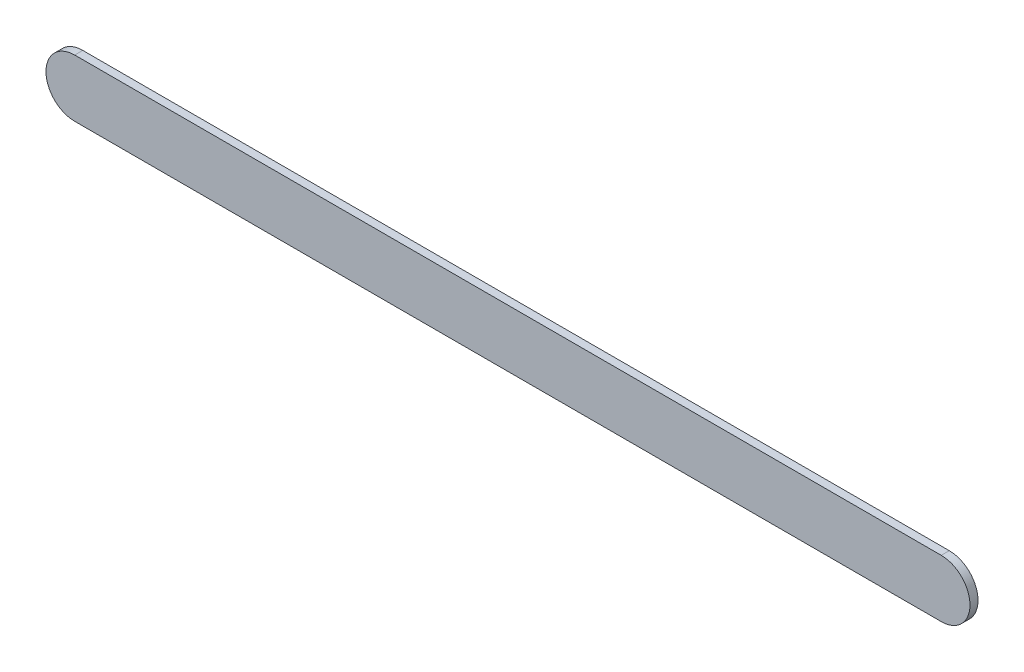
ISO-10303-21;
HEADER;
FILE_DESCRIPTION(('STEP AP214'),'2;1');
FILE_NAME('part.step','',(''),(''),'','','');
FILE_SCHEMA(('AUTOMOTIVE_DESIGN { 1 0 10303 214 1 1 1 1 }'));
ENDSEC;
DATA;
#1=APPLICATION_CONTEXT('core data for automotive mechanical design processes');
#2=APPLICATION_PROTOCOL_DEFINITION('international standard','automotive_design',2000,#1);
#3=PRODUCT_CONTEXT('',#1,'mechanical');
#4=PRODUCT('Part','Part','',(#3));
#5=PRODUCT_RELATED_PRODUCT_CATEGORY('part','',(#4));
#6=PRODUCT_DEFINITION_FORMATION('','',#4);
#7=PRODUCT_DEFINITION_CONTEXT('part definition',#1,'design');
#8=PRODUCT_DEFINITION('design','',#6,#7);
#9=PRODUCT_DEFINITION_SHAPE('','',#8);
#10=(LENGTH_UNIT() NAMED_UNIT(*) SI_UNIT(.MILLI.,.METRE.));
#11=(NAMED_UNIT(*) PLANE_ANGLE_UNIT() SI_UNIT($,.RADIAN.));
#12=(NAMED_UNIT(*) SI_UNIT($,.STERADIAN.) SOLID_ANGLE_UNIT());
#13=UNCERTAINTY_MEASURE_WITH_UNIT(LENGTH_MEASURE(1.E-05),#10,'distance_accuracy_value','');
#14=(GEOMETRIC_REPRESENTATION_CONTEXT(3) GLOBAL_UNCERTAINTY_ASSIGNED_CONTEXT((#13)) GLOBAL_UNIT_ASSIGNED_CONTEXT((#10,
#11,#12)) REPRESENTATION_CONTEXT('',''));
#15=CARTESIAN_POINT('',(0.,0.,0.));
#16=DIRECTION('',(0.,0.,1.));
#17=DIRECTION('',(1.,0.,0.));
#18=AXIS2_PLACEMENT_3D('',#15,#16,#17);
#19=CARTESIAN_POINT('',(89.58371974,91.55297158,0.));
#20=DIRECTION('',(0.,1.,0.));
#21=DIRECTION('',(1.,0.,0.));
#22=AXIS2_PLACEMENT_3D('',#19,#20,#21);
#23=PLANE('',#22);
#24=DIRECTION('',(1.,0.,0.));
#25=VECTOR('',#24,1.);
#26=CARTESIAN_POINT('',(89.58371974,91.55297158,0.03556));
#27=LINE('',#26,#25);
#28=CARTESIAN_POINT('',(89.58371974,91.55297158,0.03556));
#29=VERTEX_POINT('',#28);
#30=CARTESIAN_POINT('',(93.41697344,91.55297158,0.03556));
#31=VERTEX_POINT('',#30);
#32=EDGE_CURVE('E11',#29,#31,#27,.T.);
#33=ORIENTED_EDGE('',*,*,#32,.F.);
#34=DIRECTION('',(0.,0.,1.));
#35=VECTOR('',#34,1.);
#36=CARTESIAN_POINT('',(89.58371974,91.55297158,0.));
#37=LINE('',#36,#35);
#38=CARTESIAN_POINT('',(89.58371974,91.55297158,0.));
#39=VERTEX_POINT('',#38);
#40=EDGE_CURVE('E24',#39,#29,#37,.T.);
#41=ORIENTED_EDGE('',*,*,#40,.F.);
#42=DIRECTION('',(1.,0.,0.));
#43=VECTOR('',#42,1.);
#44=CARTESIAN_POINT('',(89.58371974,91.55297158,0.));
#45=LINE('',#44,#43);
#46=CARTESIAN_POINT('',(93.41697344,91.55297158,0.));
#47=VERTEX_POINT('',#46);
#48=EDGE_CURVE('E75',#39,#47,#45,.T.);
#49=ORIENTED_EDGE('',*,*,#48,.T.);
#50=DIRECTION('',(0.,0.,1.));
#51=VECTOR('',#50,1.);
#52=CARTESIAN_POINT('',(93.41697344,91.55297158,0.));
#53=LINE('',#52,#51);
#54=EDGE_CURVE('E37',#47,#31,#53,.T.);
#55=ORIENTED_EDGE('',*,*,#54,.T.);
#56=EDGE_LOOP('',(#33,#41,#49,#55));
#57=FACE_BOUND('',#56,.T.);
#58=ADVANCED_FACE('F17',(#57),#23,.F.);
#59=CARTESIAN_POINT('',(93.41697344,91.67997158,0.));
#60=DIRECTION('',(0.,0.,-1.));
#61=DIRECTION('',(0.,-1.,0.));
#62=AXIS2_PLACEMENT_3D('',#59,#60,#61);
#63=CYLINDRICAL_SURFACE('',#62,0.127);
#64=CARTESIAN_POINT('',(93.41697344,91.67997158,0.03556));
#65=DIRECTION('',(0.,0.,1.));
#66=DIRECTION('',(0.,-1.,0.));
#67=AXIS2_PLACEMENT_3D('',#64,#65,#66);
#68=CIRCLE('',#67,0.127);
#69=CARTESIAN_POINT('',(93.41697344,91.80697158,0.03556));
#70=VERTEX_POINT('',#69);
#71=EDGE_CURVE('E83',#31,#70,#68,.T.);
#72=ORIENTED_EDGE('',*,*,#71,.F.);
#73=ORIENTED_EDGE('',*,*,#54,.F.);
#74=CARTESIAN_POINT('',(93.41697344,91.67997158,0.));
#75=DIRECTION('',(0.,0.,1.));
#76=DIRECTION('',(0.,-1.,0.));
#77=AXIS2_PLACEMENT_3D('',#74,#75,#76);
#78=CIRCLE('',#77,0.127);
#79=CARTESIAN_POINT('',(93.41697344,91.80697158,0.));
#80=VERTEX_POINT('',#79);
#81=EDGE_CURVE('E81',#47,#80,#78,.T.);
#82=ORIENTED_EDGE('',*,*,#81,.T.);
#83=DIRECTION('',(0.,0.,1.));
#84=VECTOR('',#83,1.);
#85=CARTESIAN_POINT('',(93.41697344,91.80697158,0.));
#86=LINE('',#85,#84);
#87=EDGE_CURVE('E67',#80,#70,#86,.T.);
#88=ORIENTED_EDGE('',*,*,#87,.T.);
#89=EDGE_LOOP('',(#72,#73,#82,#88));
#90=FACE_BOUND('',#89,.T.);
#91=ADVANCED_FACE('F89',(#90),#63,.T.);
#92=CARTESIAN_POINT('',(93.41697344,91.80697158,0.));
#93=DIRECTION('',(0.,-1.,0.));
#94=DIRECTION('',(-1.,0.,0.));
#95=AXIS2_PLACEMENT_3D('',#92,#93,#94);
#96=PLANE('',#95);
#97=DIRECTION('',(-1.,0.,0.));
#98=VECTOR('',#97,1.);
#99=CARTESIAN_POINT('',(93.41697344,91.80697158,0.03556));
#100=LINE('',#99,#98);
#101=CARTESIAN_POINT('',(89.58371974,91.80697158,0.03556));
#102=VERTEX_POINT('',#101);
#103=EDGE_CURVE('E71',#70,#102,#100,.T.);
#104=ORIENTED_EDGE('',*,*,#103,.F.);
#105=ORIENTED_EDGE('',*,*,#87,.F.);
#106=DIRECTION('',(-1.,0.,0.));
#107=VECTOR('',#106,1.);
#108=CARTESIAN_POINT('',(93.41697344,91.80697158,0.));
#109=LINE('',#108,#107);
#110=CARTESIAN_POINT('',(89.58371974,91.80697158,0.));
#111=VERTEX_POINT('',#110);
#112=EDGE_CURVE('E63',#80,#111,#109,.T.);
#113=ORIENTED_EDGE('',*,*,#112,.T.);
#114=DIRECTION('',(0.,0.,1.));
#115=VECTOR('',#114,1.);
#116=CARTESIAN_POINT('',(89.58371974,91.80697158,0.));
#117=LINE('',#116,#115);
#118=EDGE_CURVE('E53',#111,#102,#117,.T.);
#119=ORIENTED_EDGE('',*,*,#118,.T.);
#120=EDGE_LOOP('',(#104,#105,#113,#119));
#121=FACE_BOUND('',#120,.T.);
#122=ADVANCED_FACE('F66',(#121),#96,.F.);
#123=CARTESIAN_POINT('',(89.58371974,91.67997158,0.));
#124=DIRECTION('',(0.,0.,-1.));
#125=DIRECTION('',(0.,1.,0.));
#126=AXIS2_PLACEMENT_3D('',#123,#124,#125);
#127=CYLINDRICAL_SURFACE('',#126,0.126999999999995);
#128=CARTESIAN_POINT('',(89.58371974,91.67997158,0.03556));
#129=DIRECTION('',(0.,0.,1.));
#130=DIRECTION('',(0.,1.,0.));
#131=AXIS2_PLACEMENT_3D('',#128,#129,#130);
#132=CIRCLE('',#131,0.126999999999995);
#133=EDGE_CURVE('E59',#102,#29,#132,.T.);
#134=ORIENTED_EDGE('',*,*,#133,.F.);
#135=ORIENTED_EDGE('',*,*,#118,.F.);
#136=CARTESIAN_POINT('',(89.58371974,91.67997158,0.));
#137=DIRECTION('',(0.,0.,1.));
#138=DIRECTION('',(0.,1.,0.));
#139=AXIS2_PLACEMENT_3D('',#136,#137,#138);
#140=CIRCLE('',#139,0.126999999999995);
#141=EDGE_CURVE('E57',#111,#39,#140,.T.);
#142=ORIENTED_EDGE('',*,*,#141,.T.);
#143=ORIENTED_EDGE('',*,*,#40,.T.);
#144=EDGE_LOOP('',(#134,#135,#142,#143));
#145=FACE_BOUND('',#144,.T.);
#146=ADVANCED_FACE('F55',(#145),#127,.T.);
#147=CARTESIAN_POINT('',(89.58371974,91.55297158,0.));
#148=DIRECTION('',(0.,0.,-1.));
#149=DIRECTION('',(-1.,0.,0.));
#150=AXIS2_PLACEMENT_3D('',#147,#148,#149);
#151=PLANE('',#150);
#152=ORIENTED_EDGE('',*,*,#141,.F.);
#153=ORIENTED_EDGE('',*,*,#112,.F.);
#154=ORIENTED_EDGE('',*,*,#81,.F.);
#155=ORIENTED_EDGE('',*,*,#48,.F.);
#156=EDGE_LOOP('',(#152,#153,#154,#155));
#157=FACE_BOUND('',#156,.T.);
#158=ADVANCED_FACE('F74',(#157),#151,.T.);
#159=CARTESIAN_POINT('',(89.58371974,91.55297158,0.03556));
#160=DIRECTION('',(0.,0.,-1.));
#161=DIRECTION('',(-1.,0.,0.));
#162=AXIS2_PLACEMENT_3D('',#159,#160,#161);
#163=PLANE('',#162);
#164=ORIENTED_EDGE('',*,*,#32,.T.);
#165=ORIENTED_EDGE('',*,*,#71,.T.);
#166=ORIENTED_EDGE('',*,*,#103,.T.);
#167=ORIENTED_EDGE('',*,*,#133,.T.);
#168=EDGE_LOOP('',(#164,#165,#166,#167));
#169=FACE_BOUND('',#168,.T.);
#170=ADVANCED_FACE('F91',(#169),#163,.F.);
#171=CLOSED_SHELL('',(#58,#91,#122,#146,#158,#170));
#172=MANIFOLD_SOLID_BREP('B1',#171);
#173=ADVANCED_BREP_SHAPE_REPRESENTATION('',(#18,#172),#14);
#174=SHAPE_DEFINITION_REPRESENTATION(#9,#173);
ENDSEC;
END-ISO-10303-21;
